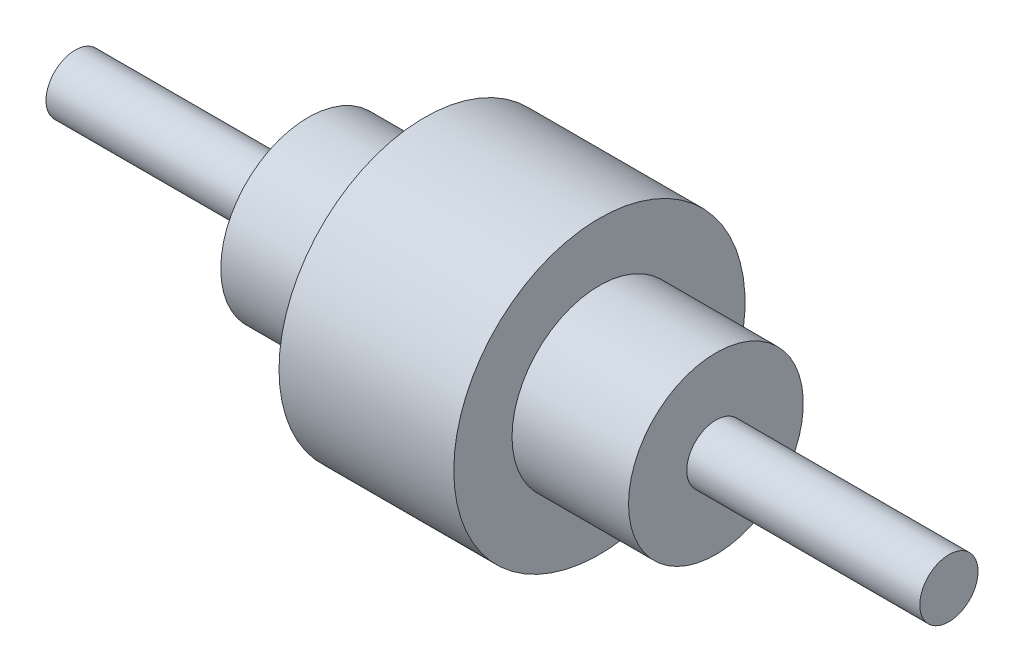
ISO-10303-21;
HEADER;
FILE_DESCRIPTION(('STEP AP214'),'2;1');
FILE_NAME('part.step','',(''),(''),'','','');
FILE_SCHEMA(('AUTOMOTIVE_DESIGN { 1 0 10303 214 1 1 1 1 }'));
ENDSEC;
DATA;
#1=APPLICATION_CONTEXT('core data for automotive mechanical design processes');
#2=APPLICATION_PROTOCOL_DEFINITION('international standard','automotive_design',2000,#1);
#3=PRODUCT_CONTEXT('',#1,'mechanical');
#4=PRODUCT('Part','Part','',(#3));
#5=PRODUCT_RELATED_PRODUCT_CATEGORY('part','',(#4));
#6=PRODUCT_DEFINITION_FORMATION('','',#4);
#7=PRODUCT_DEFINITION_CONTEXT('part definition',#1,'design');
#8=PRODUCT_DEFINITION('design','',#6,#7);
#9=PRODUCT_DEFINITION_SHAPE('','',#8);
#10=(LENGTH_UNIT() NAMED_UNIT(*) SI_UNIT(.MILLI.,.METRE.));
#11=(NAMED_UNIT(*) PLANE_ANGLE_UNIT() SI_UNIT($,.RADIAN.));
#12=(NAMED_UNIT(*) SI_UNIT($,.STERADIAN.) SOLID_ANGLE_UNIT());
#13=UNCERTAINTY_MEASURE_WITH_UNIT(LENGTH_MEASURE(1.E-05),#10,'distance_accuracy_value','');
#14=(GEOMETRIC_REPRESENTATION_CONTEXT(3) GLOBAL_UNCERTAINTY_ASSIGNED_CONTEXT((#13)) GLOBAL_UNIT_ASSIGNED_CONTEXT((#10,
#11,#12)) REPRESENTATION_CONTEXT('',''));
#15=CARTESIAN_POINT('',(0.,0.,0.));
#16=DIRECTION('',(0.,0.,1.));
#17=DIRECTION('',(1.,0.,0.));
#18=AXIS2_PLACEMENT_3D('',#15,#16,#17);
#19=CARTESIAN_POINT('',(0.,10.,0.));
#20=DIRECTION('',(1.,0.,0.));
#21=DIRECTION('',(0.,0.,-1.));
#22=AXIS2_PLACEMENT_3D('',#19,#20,#21);
#23=PLANE('',#22);
#24=CARTESIAN_POINT('',(0.,0.,0.));
#25=DIRECTION('',(-1.,0.,0.));
#26=DIRECTION('',(0.,0.,1.));
#27=AXIS2_PLACEMENT_3D('',#24,#25,#26);
#28=CIRCLE('',#27,10.);
#29=CARTESIAN_POINT('',(0.,0.,10.));
#30=VERTEX_POINT('',#29);
#31=EDGE_CURVE('E10',#30,#30,#28,.T.);
#32=ORIENTED_EDGE('',*,*,#31,.T.);
#33=EDGE_LOOP('',(#32));
#34=FACE_BOUND('',#33,.T.);
#35=ADVANCED_FACE('F31',(#34),#23,.F.);
#36=CARTESIAN_POINT('',(0.,0.,0.));
#37=DIRECTION('',(-1.,0.,0.));
#38=DIRECTION('',(0.,0.,1.));
#39=AXIS2_PLACEMENT_3D('',#36,#37,#38);
#40=CYLINDRICAL_SURFACE('',#39,10.);
#41=ORIENTED_EDGE('',*,*,#31,.F.);
#42=EDGE_LOOP('',(#41));
#43=FACE_BOUND('',#42,.T.);
#44=CARTESIAN_POINT('',(80.,0.,0.));
#45=DIRECTION('',(-1.,0.,0.));
#46=DIRECTION('',(0.,0.,1.));
#47=AXIS2_PLACEMENT_3D('',#44,#45,#46);
#48=CIRCLE('',#47,10.);
#49=CARTESIAN_POINT('',(80.,0.,10.));
#50=VERTEX_POINT('',#49);
#51=EDGE_CURVE('E37',#50,#50,#48,.T.);
#52=ORIENTED_EDGE('',*,*,#51,.T.);
#53=EDGE_LOOP('',(#52));
#54=FACE_BOUND('',#53,.T.);
#55=ADVANCED_FACE('F81',(#43,#54),#40,.T.);
#56=CARTESIAN_POINT('',(80.,10.,0.));
#57=DIRECTION('',(1.,0.,0.));
#58=DIRECTION('',(0.,0.,-1.));
#59=AXIS2_PLACEMENT_3D('',#56,#57,#58);
#60=PLANE('',#59);
#61=ORIENTED_EDGE('',*,*,#51,.F.);
#62=EDGE_LOOP('',(#61));
#63=FACE_BOUND('',#62,.T.);
#64=CARTESIAN_POINT('',(80.,0.,0.));
#65=DIRECTION('',(-1.,0.,0.));
#66=DIRECTION('',(0.,0.,1.));
#67=AXIS2_PLACEMENT_3D('',#64,#65,#66);
#68=CIRCLE('',#67,30.);
#69=CARTESIAN_POINT('',(80.,0.,30.));
#70=VERTEX_POINT('',#69);
#71=EDGE_CURVE('E41',#70,#70,#68,.T.);
#72=ORIENTED_EDGE('',*,*,#71,.T.);
#73=EDGE_LOOP('',(#72));
#74=FACE_BOUND('',#73,.T.);
#75=ADVANCED_FACE('F85',(#63,#74),#60,.F.);
#76=CARTESIAN_POINT('',(0.,0.,0.));
#77=DIRECTION('',(-1.,0.,0.));
#78=DIRECTION('',(0.,0.,1.));
#79=AXIS2_PLACEMENT_3D('',#76,#77,#78);
#80=CYLINDRICAL_SURFACE('',#79,30.);
#81=ORIENTED_EDGE('',*,*,#71,.F.);
#82=EDGE_LOOP('',(#81));
#83=FACE_BOUND('',#82,.T.);
#84=CARTESIAN_POINT('',(120.,0.,0.));
#85=DIRECTION('',(-1.,0.,0.));
#86=DIRECTION('',(0.,0.,1.));
#87=AXIS2_PLACEMENT_3D('',#84,#85,#86);
#88=CIRCLE('',#87,30.);
#89=CARTESIAN_POINT('',(120.,0.,30.));
#90=VERTEX_POINT('',#89);
#91=EDGE_CURVE('E45',#90,#90,#88,.T.);
#92=ORIENTED_EDGE('',*,*,#91,.T.);
#93=EDGE_LOOP('',(#92));
#94=FACE_BOUND('',#93,.T.);
#95=ADVANCED_FACE('F90',(#83,#94),#80,.T.);
#96=CARTESIAN_POINT('',(120.,30.,0.));
#97=DIRECTION('',(1.,0.,0.));
#98=DIRECTION('',(0.,0.,-1.));
#99=AXIS2_PLACEMENT_3D('',#96,#97,#98);
#100=PLANE('',#99);
#101=ORIENTED_EDGE('',*,*,#91,.F.);
#102=EDGE_LOOP('',(#101));
#103=FACE_BOUND('',#102,.T.);
#104=CARTESIAN_POINT('',(120.,0.,0.));
#105=DIRECTION('',(-1.,0.,0.));
#106=DIRECTION('',(0.,0.,1.));
#107=AXIS2_PLACEMENT_3D('',#104,#105,#106);
#108=CIRCLE('',#107,50.);
#109=CARTESIAN_POINT('',(120.,0.,50.));
#110=VERTEX_POINT('',#109);
#111=EDGE_CURVE('E50',#110,#110,#108,.T.);
#112=ORIENTED_EDGE('',*,*,#111,.T.);
#113=EDGE_LOOP('',(#112));
#114=FACE_BOUND('',#113,.T.);
#115=ADVANCED_FACE('F96',(#103,#114),#100,.F.);
#116=CARTESIAN_POINT('',(0.,0.,0.));
#117=DIRECTION('',(-1.,0.,0.));
#118=DIRECTION('',(0.,0.,1.));
#119=AXIS2_PLACEMENT_3D('',#116,#117,#118);
#120=CYLINDRICAL_SURFACE('',#119,50.);
#121=ORIENTED_EDGE('',*,*,#111,.F.);
#122=EDGE_LOOP('',(#121));
#123=FACE_BOUND('',#122,.T.);
#124=CARTESIAN_POINT('',(180.,0.,0.));
#125=DIRECTION('',(-1.,0.,0.));
#126=DIRECTION('',(0.,0.,1.));
#127=AXIS2_PLACEMENT_3D('',#124,#125,#126);
#128=CIRCLE('',#127,50.);
#129=CARTESIAN_POINT('',(180.,0.,50.));
#130=VERTEX_POINT('',#129);
#131=EDGE_CURVE('E53',#130,#130,#128,.T.);
#132=ORIENTED_EDGE('',*,*,#131,.T.);
#133=EDGE_LOOP('',(#132));
#134=FACE_BOUND('',#133,.T.);
#135=ADVANCED_FACE('F100',(#123,#134),#120,.T.);
#136=CARTESIAN_POINT('',(180.,30.,0.));
#137=DIRECTION('',(-1.,0.,0.));
#138=DIRECTION('',(0.,0.,1.));
#139=AXIS2_PLACEMENT_3D('',#136,#137,#138);
#140=PLANE('',#139);
#141=ORIENTED_EDGE('',*,*,#131,.F.);
#142=EDGE_LOOP('',(#141));
#143=FACE_BOUND('',#142,.T.);
#144=CARTESIAN_POINT('',(180.,0.,0.));
#145=DIRECTION('',(-1.,0.,0.));
#146=DIRECTION('',(0.,0.,1.));
#147=AXIS2_PLACEMENT_3D('',#144,#145,#146);
#148=CIRCLE('',#147,30.);
#149=CARTESIAN_POINT('',(180.,0.,30.));
#150=VERTEX_POINT('',#149);
#151=EDGE_CURVE('E56',#150,#150,#148,.T.);
#152=ORIENTED_EDGE('',*,*,#151,.T.);
#153=EDGE_LOOP('',(#152));
#154=FACE_BOUND('',#153,.T.);
#155=ADVANCED_FACE('F104',(#143,#154),#140,.F.);
#156=CARTESIAN_POINT('',(0.,0.,0.));
#157=DIRECTION('',(-1.,0.,0.));
#158=DIRECTION('',(0.,0.,1.));
#159=AXIS2_PLACEMENT_3D('',#156,#157,#158);
#160=CYLINDRICAL_SURFACE('',#159,30.);
#161=ORIENTED_EDGE('',*,*,#151,.F.);
#162=EDGE_LOOP('',(#161));
#163=FACE_BOUND('',#162,.T.);
#164=CARTESIAN_POINT('',(220.,0.,0.));
#165=DIRECTION('',(-1.,0.,0.));
#166=DIRECTION('',(0.,0.,1.));
#167=AXIS2_PLACEMENT_3D('',#164,#165,#166);
#168=CIRCLE('',#167,30.);
#169=CARTESIAN_POINT('',(220.,0.,30.));
#170=VERTEX_POINT('',#169);
#171=EDGE_CURVE('E59',#170,#170,#168,.T.);
#172=ORIENTED_EDGE('',*,*,#171,.T.);
#173=EDGE_LOOP('',(#172));
#174=FACE_BOUND('',#173,.T.);
#175=ADVANCED_FACE('F108',(#163,#174),#160,.T.);
#176=CARTESIAN_POINT('',(220.,10.,0.));
#177=DIRECTION('',(-1.,0.,0.));
#178=DIRECTION('',(0.,0.,1.));
#179=AXIS2_PLACEMENT_3D('',#176,#177,#178);
#180=PLANE('',#179);
#181=ORIENTED_EDGE('',*,*,#171,.F.);
#182=EDGE_LOOP('',(#181));
#183=FACE_BOUND('',#182,.T.);
#184=CARTESIAN_POINT('',(220.,0.,0.));
#185=DIRECTION('',(-1.,0.,0.));
#186=DIRECTION('',(0.,0.,1.));
#187=AXIS2_PLACEMENT_3D('',#184,#185,#186);
#188=CIRCLE('',#187,10.);
#189=CARTESIAN_POINT('',(220.,0.,10.));
#190=VERTEX_POINT('',#189);
#191=EDGE_CURVE('E62',#190,#190,#188,.T.);
#192=ORIENTED_EDGE('',*,*,#191,.T.);
#193=EDGE_LOOP('',(#192));
#194=FACE_BOUND('',#193,.T.);
#195=ADVANCED_FACE('F77',(#183,#194),#180,.F.);
#196=CARTESIAN_POINT('',(0.,0.,0.));
#197=DIRECTION('',(-1.,0.,0.));
#198=DIRECTION('',(0.,0.,1.));
#199=AXIS2_PLACEMENT_3D('',#196,#197,#198);
#200=CYLINDRICAL_SURFACE('',#199,10.);
#201=ORIENTED_EDGE('',*,*,#191,.F.);
#202=EDGE_LOOP('',(#201));
#203=FACE_BOUND('',#202,.T.);
#204=CARTESIAN_POINT('',(300.,0.,0.));
#205=DIRECTION('',(-1.,0.,0.));
#206=DIRECTION('',(0.,0.,1.));
#207=AXIS2_PLACEMENT_3D('',#204,#205,#206);
#208=CIRCLE('',#207,10.);
#209=CARTESIAN_POINT('',(300.,0.,10.));
#210=VERTEX_POINT('',#209);
#211=EDGE_CURVE('E65',#210,#210,#208,.T.);
#212=ORIENTED_EDGE('',*,*,#211,.T.);
#213=EDGE_LOOP('',(#212));
#214=FACE_BOUND('',#213,.T.);
#215=ADVANCED_FACE('F69',(#203,#214),#200,.T.);
#216=CARTESIAN_POINT('',(300.,10.,0.));
#217=DIRECTION('',(-1.,0.,0.));
#218=DIRECTION('',(0.,0.,1.));
#219=AXIS2_PLACEMENT_3D('',#216,#217,#218);
#220=PLANE('',#219);
#221=ORIENTED_EDGE('',*,*,#211,.F.);
#222=EDGE_LOOP('',(#221));
#223=FACE_BOUND('',#222,.T.);
#224=ADVANCED_FACE('F71',(#223),#220,.F.);
#225=CLOSED_SHELL('',(#35,#55,#75,#95,#115,#135,#155,#175,#195,#215,#224));
#226=MANIFOLD_SOLID_BREP('B2',#225);
#227=ADVANCED_BREP_SHAPE_REPRESENTATION('',(#18,#226),#14);
#228=SHAPE_DEFINITION_REPRESENTATION(#9,#227);
ENDSEC;
END-ISO-10303-21;
